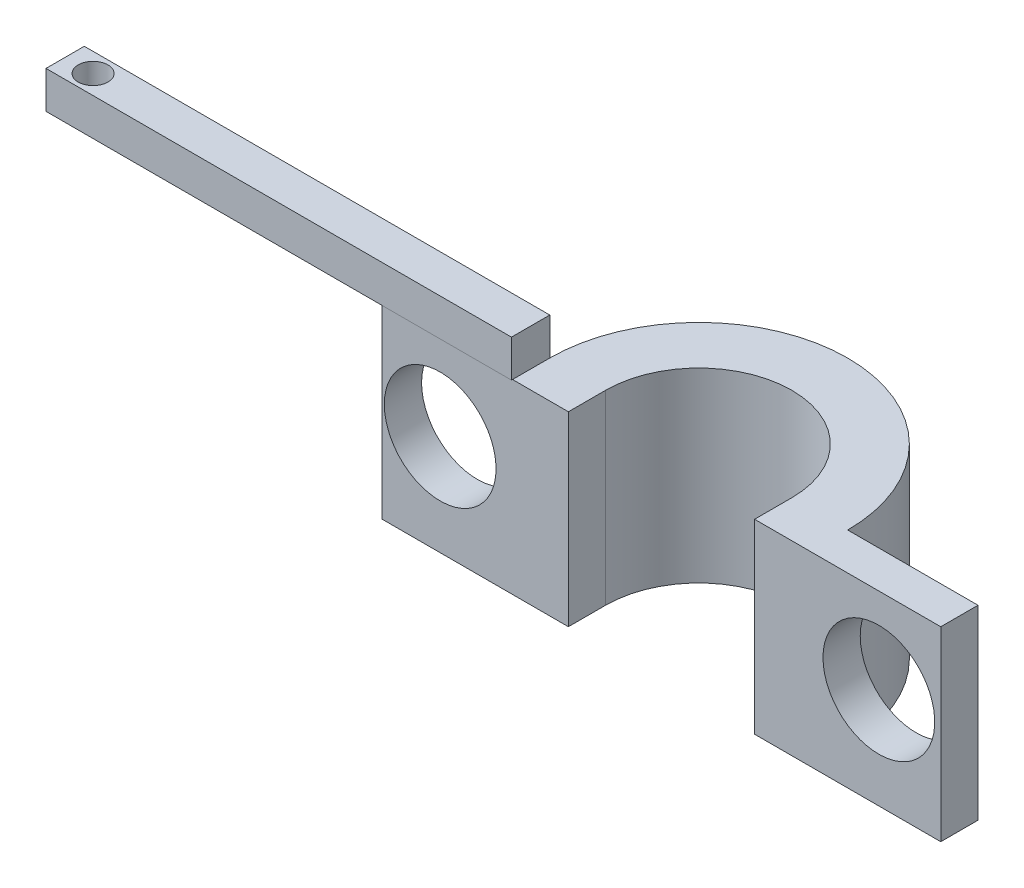
ISO-10303-21;
HEADER;
FILE_DESCRIPTION(('STEP AP214'),'2;1');
FILE_NAME('part.step','',(''),(''),'','','');
FILE_SCHEMA(('AUTOMOTIVE_DESIGN { 1 0 10303 214 1 1 1 1 }'));
ENDSEC;
DATA;
#1=APPLICATION_CONTEXT('core data for automotive mechanical design processes');
#2=APPLICATION_PROTOCOL_DEFINITION('international standard','automotive_design',2000,#1);
#3=PRODUCT_CONTEXT('',#1,'mechanical');
#4=PRODUCT('Part','Part','',(#3));
#5=PRODUCT_RELATED_PRODUCT_CATEGORY('part','',(#4));
#6=PRODUCT_DEFINITION_FORMATION('','',#4);
#7=PRODUCT_DEFINITION_CONTEXT('part definition',#1,'design');
#8=PRODUCT_DEFINITION('design','',#6,#7);
#9=PRODUCT_DEFINITION_SHAPE('','',#8);
#10=(LENGTH_UNIT() NAMED_UNIT(*) SI_UNIT(.MILLI.,.METRE.));
#11=(NAMED_UNIT(*) PLANE_ANGLE_UNIT() SI_UNIT($,.RADIAN.));
#12=(NAMED_UNIT(*) SI_UNIT($,.STERADIAN.) SOLID_ANGLE_UNIT());
#13=UNCERTAINTY_MEASURE_WITH_UNIT(LENGTH_MEASURE(1.E-05),#10,'distance_accuracy_value','');
#14=(GEOMETRIC_REPRESENTATION_CONTEXT(3) GLOBAL_UNCERTAINTY_ASSIGNED_CONTEXT((#13)) GLOBAL_UNIT_ASSIGNED_CONTEXT((#10,
#11,#12)) REPRESENTATION_CONTEXT('',''));
#15=CARTESIAN_POINT('',(0.,0.,0.));
#16=DIRECTION('',(0.,0.,1.));
#17=DIRECTION('',(1.,0.,0.));
#18=AXIS2_PLACEMENT_3D('',#15,#16,#17);
#19=CARTESIAN_POINT('',(0.,10.,0.));
#20=DIRECTION('',(0.,1.,0.));
#21=DIRECTION('',(0.,0.,1.));
#22=AXIS2_PLACEMENT_3D('',#19,#20,#21);
#23=PLANE('',#22);
#24=DIRECTION('',(0.,0.,-1.));
#25=VECTOR('',#24,1.);
#26=CARTESIAN_POINT('',(-8.,10.,0.));
#27=LINE('',#26,#25);
#28=CARTESIAN_POINT('',(-8.,10.,2.));
#29=VERTEX_POINT('',#28);
#30=CARTESIAN_POINT('',(-8.,10.,0.));
#31=VERTEX_POINT('',#30);
#32=EDGE_CURVE('E12',#29,#31,#27,.T.);
#33=ORIENTED_EDGE('',*,*,#32,.F.);
#34=DIRECTION('',(-1.,0.,0.));
#35=VECTOR('',#34,1.);
#36=CARTESIAN_POINT('',(-5.,10.,2.));
#37=LINE('',#36,#35);
#38=CARTESIAN_POINT('',(-5.,10.,2.));
#39=VERTEX_POINT('',#38);
#40=EDGE_CURVE('E290',#39,#29,#37,.T.);
#41=ORIENTED_EDGE('',*,*,#40,.F.);
#42=DIRECTION('',(0.,0.,-1.));
#43=VECTOR('',#42,1.);
#44=CARTESIAN_POINT('',(-5.,10.,2.));
#45=LINE('',#44,#43);
#46=CARTESIAN_POINT('',(-5.,10.,0.));
#47=VERTEX_POINT('',#46);
#48=EDGE_CURVE('E303',#39,#47,#45,.T.);
#49=ORIENTED_EDGE('',*,*,#48,.T.);
#50=CARTESIAN_POINT('',(0.,10.,0.));
#51=DIRECTION('',(0.,1.,0.));
#52=DIRECTION('',(0.,0.,1.));
#53=AXIS2_PLACEMENT_3D('',#50,#51,#52);
#54=CIRCLE('',#53,5.);
#55=CARTESIAN_POINT('',(5.,10.,0.));
#56=VERTEX_POINT('',#55);
#57=EDGE_CURVE('E338',#56,#47,#54,.T.);
#58=ORIENTED_EDGE('',*,*,#57,.F.);
#59=DIRECTION('',(0.,0.,-1.));
#60=VECTOR('',#59,1.);
#61=CARTESIAN_POINT('',(5.,10.,2.));
#62=LINE('',#61,#60);
#63=CARTESIAN_POINT('',(5.,10.,2.));
#64=VERTEX_POINT('',#63);
#65=EDGE_CURVE('E316',#64,#56,#62,.T.);
#66=ORIENTED_EDGE('',*,*,#65,.F.);
#67=DIRECTION('',(-1.,0.,0.));
#68=VECTOR('',#67,1.);
#69=CARTESIAN_POINT('',(5.,10.,2.));
#70=LINE('',#69,#68);
#71=CARTESIAN_POINT('',(15.,10.,2.));
#72=VERTEX_POINT('',#71);
#73=EDGE_CURVE('E314',#72,#64,#70,.T.);
#74=ORIENTED_EDGE('',*,*,#73,.F.);
#75=DIRECTION('',(0.,0.,-1.));
#76=VECTOR('',#75,1.);
#77=CARTESIAN_POINT('',(15.,10.,2.));
#78=LINE('',#77,#76);
#79=CARTESIAN_POINT('',(15.,10.,0.));
#80=VERTEX_POINT('',#79);
#81=EDGE_CURVE('E324',#72,#80,#78,.T.);
#82=ORIENTED_EDGE('',*,*,#81,.T.);
#83=DIRECTION('',(-1.,0.,0.));
#84=VECTOR('',#83,1.);
#85=CARTESIAN_POINT('',(5.,10.,0.));
#86=LINE('',#85,#84);
#87=CARTESIAN_POINT('',(8.,10.,0.));
#88=VERTEX_POINT('',#87);
#89=EDGE_CURVE('E310',#80,#88,#86,.T.);
#90=ORIENTED_EDGE('',*,*,#89,.T.);
#91=CARTESIAN_POINT('',(0.,10.,0.));
#92=DIRECTION('',(0.,1.,0.));
#93=DIRECTION('',(1.,0.,0.));
#94=AXIS2_PLACEMENT_3D('',#91,#92,#93);
#95=CIRCLE('',#94,8.);
#96=EDGE_CURVE('E343',#88,#31,#95,.T.);
#97=ORIENTED_EDGE('',*,*,#96,.T.);
#98=EDGE_LOOP('',(#33,#41,#49,#58,#66,#74,#82,#90,#97));
#99=FACE_BOUND('',#98,.T.);
#100=ADVANCED_FACE('F39',(#99),#23,.T.);
#101=CARTESIAN_POINT('',(0.,0.,0.));
#102=DIRECTION('',(0.,1.,0.));
#103=DIRECTION('',(0.,0.,1.));
#104=AXIS2_PLACEMENT_3D('',#101,#102,#103);
#105=PLANE('',#104);
#106=CARTESIAN_POINT('',(0.,0.,0.));
#107=DIRECTION('',(0.,1.,0.));
#108=DIRECTION('',(1.,0.,0.));
#109=AXIS2_PLACEMENT_3D('',#106,#107,#108);
#110=CIRCLE('',#109,8.);
#111=CARTESIAN_POINT('',(8.,0.,0.));
#112=VERTEX_POINT('',#111);
#113=CARTESIAN_POINT('',(-8.,0.,0.));
#114=VERTEX_POINT('',#113);
#115=EDGE_CURVE('E341',#112,#114,#110,.T.);
#116=ORIENTED_EDGE('',*,*,#115,.F.);
#117=DIRECTION('',(1.,0.,0.));
#118=VECTOR('',#117,1.);
#119=CARTESIAN_POINT('',(5.,0.,0.));
#120=LINE('',#119,#118);
#121=CARTESIAN_POINT('',(15.,0.,0.));
#122=VERTEX_POINT('',#121);
#123=EDGE_CURVE('E305',#112,#122,#120,.T.);
#124=ORIENTED_EDGE('',*,*,#123,.T.);
#125=DIRECTION('',(0.,0.,-1.));
#126=VECTOR('',#125,1.);
#127=CARTESIAN_POINT('',(15.,0.,2.));
#128=LINE('',#127,#126);
#129=CARTESIAN_POINT('',(15.,0.,2.));
#130=VERTEX_POINT('',#129);
#131=EDGE_CURVE('E327',#130,#122,#128,.T.);
#132=ORIENTED_EDGE('',*,*,#131,.F.);
#133=DIRECTION('',(1.,0.,0.));
#134=VECTOR('',#133,1.);
#135=CARTESIAN_POINT('',(5.,0.,2.));
#136=LINE('',#135,#134);
#137=CARTESIAN_POINT('',(5.,0.,2.));
#138=VERTEX_POINT('',#137);
#139=EDGE_CURVE('E309',#138,#130,#136,.T.);
#140=ORIENTED_EDGE('',*,*,#139,.F.);
#141=DIRECTION('',(0.,0.,-1.));
#142=VECTOR('',#141,1.);
#143=CARTESIAN_POINT('',(5.,0.,2.));
#144=LINE('',#143,#142);
#145=CARTESIAN_POINT('',(5.,0.,0.));
#146=VERTEX_POINT('',#145);
#147=EDGE_CURVE('E330',#138,#146,#144,.T.);
#148=ORIENTED_EDGE('',*,*,#147,.T.);
#149=CARTESIAN_POINT('',(0.,0.,0.));
#150=DIRECTION('',(0.,1.,0.));
#151=DIRECTION('',(0.,0.,1.));
#152=AXIS2_PLACEMENT_3D('',#149,#150,#151);
#153=CIRCLE('',#152,5.);
#154=CARTESIAN_POINT('',(-5.,0.,0.));
#155=VERTEX_POINT('',#154);
#156=EDGE_CURVE('E63',#146,#155,#153,.T.);
#157=ORIENTED_EDGE('',*,*,#156,.T.);
#158=DIRECTION('',(0.,0.,-1.));
#159=VECTOR('',#158,1.);
#160=CARTESIAN_POINT('',(-5.,0.,2.));
#161=LINE('',#160,#159);
#162=CARTESIAN_POINT('',(-5.,0.,2.));
#163=VERTEX_POINT('',#162);
#164=EDGE_CURVE('E296',#163,#155,#161,.T.);
#165=ORIENTED_EDGE('',*,*,#164,.F.);
#166=DIRECTION('',(1.,0.,0.));
#167=VECTOR('',#166,1.);
#168=CARTESIAN_POINT('',(-5.,0.,2.));
#169=LINE('',#168,#167);
#170=CARTESIAN_POINT('',(-15.,0.,2.));
#171=VERTEX_POINT('',#170);
#172=EDGE_CURVE('E294',#171,#163,#169,.T.);
#173=ORIENTED_EDGE('',*,*,#172,.F.);
#174=DIRECTION('',(0.,0.,-1.));
#175=VECTOR('',#174,1.);
#176=CARTESIAN_POINT('',(-15.,0.,2.));
#177=LINE('',#176,#175);
#178=CARTESIAN_POINT('',(-15.,0.,0.));
#179=VERTEX_POINT('',#178);
#180=EDGE_CURVE('E299',#171,#179,#177,.T.);
#181=ORIENTED_EDGE('',*,*,#180,.T.);
#182=DIRECTION('',(1.,0.,0.));
#183=VECTOR('',#182,1.);
#184=CARTESIAN_POINT('',(-5.,0.,0.));
#185=LINE('',#184,#183);
#186=EDGE_CURVE('E289',#179,#114,#185,.T.);
#187=ORIENTED_EDGE('',*,*,#186,.T.);
#188=EDGE_LOOP('',(#116,#124,#132,#140,#148,#157,#165,#173,#181,#187));
#189=FACE_BOUND('',#188,.T.);
#190=ADVANCED_FACE('F219',(#189),#105,.F.);
#191=CARTESIAN_POINT('',(0.,10.,0.));
#192=DIRECTION('',(0.,-1.,0.));
#193=DIRECTION('',(0.,0.,-1.));
#194=AXIS2_PLACEMENT_3D('',#191,#192,#193);
#195=CYLINDRICAL_SURFACE('',#194,8.);
#196=ORIENTED_EDGE('',*,*,#96,.F.);
#197=DIRECTION('',(0.,1.,0.));
#198=VECTOR('',#197,1.);
#199=CARTESIAN_POINT('',(8.,0.,0.));
#200=LINE('',#199,#198);
#201=EDGE_CURVE('E332',#112,#88,#200,.T.);
#202=ORIENTED_EDGE('',*,*,#201,.F.);
#203=ORIENTED_EDGE('',*,*,#115,.T.);
#204=DIRECTION('',(0.,1.,0.));
#205=VECTOR('',#204,1.);
#206=CARTESIAN_POINT('',(-8.,0.,0.));
#207=LINE('',#206,#205);
#208=EDGE_CURVE('E333',#114,#31,#207,.T.);
#209=ORIENTED_EDGE('',*,*,#208,.T.);
#210=EDGE_LOOP('',(#196,#202,#203,#209));
#211=FACE_BOUND('',#210,.T.);
#212=ADVANCED_FACE('F41',(#211),#195,.T.);
#213=CARTESIAN_POINT('',(0.,10.,0.));
#214=DIRECTION('',(0.,-1.,0.));
#215=DIRECTION('',(0.,0.,-1.));
#216=AXIS2_PLACEMENT_3D('',#213,#214,#215);
#217=CYLINDRICAL_SURFACE('',#216,5.);
#218=DIRECTION('',(0.,-1.,0.));
#219=VECTOR('',#218,1.);
#220=CARTESIAN_POINT('',(5.,10.,0.));
#221=LINE('',#220,#219);
#222=EDGE_CURVE('E48',#56,#146,#221,.T.);
#223=ORIENTED_EDGE('',*,*,#222,.F.);
#224=ORIENTED_EDGE('',*,*,#57,.T.);
#225=DIRECTION('',(0.,-1.,0.));
#226=VECTOR('',#225,1.);
#227=CARTESIAN_POINT('',(-5.,10.,0.));
#228=LINE('',#227,#226);
#229=EDGE_CURVE('E345',#155,#47,#228,.F.);
#230=ORIENTED_EDGE('',*,*,#229,.F.);
#231=ORIENTED_EDGE('',*,*,#156,.F.);
#232=EDGE_LOOP('',(#223,#224,#230,#231));
#233=FACE_BOUND('',#232,.T.);
#234=ADVANCED_FACE('F228',(#233),#217,.F.);
#235=CARTESIAN_POINT('',(0.,0.,0.));
#236=DIRECTION('',(0.,0.,1.));
#237=DIRECTION('',(1.,0.,0.));
#238=AXIS2_PLACEMENT_3D('',#235,#236,#237);
#239=PLANE('',#238);
#240=CARTESIAN_POINT('',(11.6742620763688,5.40681404768861,0.));
#241=DIRECTION('',(0.,0.,-1.));
#242=DIRECTION('',(-1.,0.,0.));
#243=AXIS2_PLACEMENT_3D('',#240,#241,#242);
#244=CIRCLE('',#243,3.);
#245=CARTESIAN_POINT('',(8.67426207636879,5.40681404768861,0.));
#246=VERTEX_POINT('',#245);
#247=EDGE_CURVE('E276',#246,#246,#244,.T.);
#248=ORIENTED_EDGE('',*,*,#247,.F.);
#249=EDGE_LOOP('',(#248));
#250=FACE_BOUND('',#249,.T.);
#251=ORIENTED_EDGE('',*,*,#123,.F.);
#252=ORIENTED_EDGE('',*,*,#201,.T.);
#253=ORIENTED_EDGE('',*,*,#89,.F.);
#254=DIRECTION('',(0.,1.,0.));
#255=VECTOR('',#254,1.);
#256=CARTESIAN_POINT('',(15.,10.,0.));
#257=LINE('',#256,#255);
#258=EDGE_CURVE('E318',#122,#80,#257,.T.);
#259=ORIENTED_EDGE('',*,*,#258,.F.);
#260=EDGE_LOOP('',(#251,#252,#253,#259));
#261=FACE_BOUND('',#260,.T.);
#262=ADVANCED_FACE('F231',(#250,#261),#239,.F.);
#263=CARTESIAN_POINT('',(5.,10.,2.));
#264=DIRECTION('',(1.,0.,0.));
#265=DIRECTION('',(0.,0.,-1.));
#266=AXIS2_PLACEMENT_3D('',#263,#264,#265);
#267=PLANE('',#266);
#268=ORIENTED_EDGE('',*,*,#222,.T.);
#269=ORIENTED_EDGE('',*,*,#147,.F.);
#270=DIRECTION('',(0.,-1.,0.));
#271=VECTOR('',#270,1.);
#272=CARTESIAN_POINT('',(5.,10.,2.));
#273=LINE('',#272,#271);
#274=EDGE_CURVE('E306',#64,#138,#273,.T.);
#275=ORIENTED_EDGE('',*,*,#274,.F.);
#276=ORIENTED_EDGE('',*,*,#65,.T.);
#277=EDGE_LOOP('',(#268,#269,#275,#276));
#278=FACE_BOUND('',#277,.T.);
#279=ADVANCED_FACE('F232',(#278),#267,.F.);
#280=CARTESIAN_POINT('',(15.,10.,2.));
#281=DIRECTION('',(-1.,0.,0.));
#282=DIRECTION('',(0.,-1.,0.));
#283=AXIS2_PLACEMENT_3D('',#280,#281,#282);
#284=PLANE('',#283);
#285=ORIENTED_EDGE('',*,*,#258,.T.);
#286=ORIENTED_EDGE('',*,*,#81,.F.);
#287=DIRECTION('',(0.,1.,0.));
#288=VECTOR('',#287,1.);
#289=CARTESIAN_POINT('',(15.,10.,2.));
#290=LINE('',#289,#288);
#291=EDGE_CURVE('E312',#130,#72,#290,.T.);
#292=ORIENTED_EDGE('',*,*,#291,.F.);
#293=ORIENTED_EDGE('',*,*,#131,.T.);
#294=EDGE_LOOP('',(#285,#286,#292,#293));
#295=FACE_BOUND('',#294,.T.);
#296=ADVANCED_FACE('F235',(#295),#284,.F.);
#297=CARTESIAN_POINT('',(0.,0.,2.));
#298=DIRECTION('',(0.,0.,1.));
#299=DIRECTION('',(1.,0.,0.));
#300=AXIS2_PLACEMENT_3D('',#297,#298,#299);
#301=PLANE('',#300);
#302=CARTESIAN_POINT('',(11.6742620763688,5.40681404768861,2.));
#303=DIRECTION('',(0.,0.,-1.));
#304=DIRECTION('',(-1.,0.,0.));
#305=AXIS2_PLACEMENT_3D('',#302,#303,#304);
#306=CIRCLE('',#305,3.);
#307=CARTESIAN_POINT('',(8.67426207636879,5.40681404768861,2.));
#308=VERTEX_POINT('',#307);
#309=EDGE_CURVE('E278',#308,#308,#306,.T.);
#310=ORIENTED_EDGE('',*,*,#309,.T.);
#311=EDGE_LOOP('',(#310));
#312=FACE_BOUND('',#311,.T.);
#313=ORIENTED_EDGE('',*,*,#274,.T.);
#314=ORIENTED_EDGE('',*,*,#139,.T.);
#315=ORIENTED_EDGE('',*,*,#291,.T.);
#316=ORIENTED_EDGE('',*,*,#73,.T.);
#317=EDGE_LOOP('',(#313,#314,#315,#316));
#318=FACE_BOUND('',#317,.T.);
#319=ADVANCED_FACE('F239',(#312,#318),#301,.T.);
#320=CARTESIAN_POINT('',(0.,0.,0.));
#321=DIRECTION('',(0.,0.,-1.));
#322=DIRECTION('',(-1.,0.,0.));
#323=AXIS2_PLACEMENT_3D('',#320,#321,#322);
#324=PLANE('',#323);
#325=CARTESIAN_POINT('',(-11.8859313947723,5.40681404768861,0.));
#326=DIRECTION('',(0.,0.,-1.));
#327=DIRECTION('',(-1.,0.,0.));
#328=AXIS2_PLACEMENT_3D('',#325,#326,#327);
#329=CIRCLE('',#328,3.);
#330=CARTESIAN_POINT('',(-14.8859313947723,5.40681404768861,0.));
#331=VERTEX_POINT('',#330);
#332=EDGE_CURVE('E167',#331,#331,#329,.T.);
#333=ORIENTED_EDGE('',*,*,#332,.F.);
#334=EDGE_LOOP('',(#333));
#335=FACE_BOUND('',#334,.T.);
#336=ORIENTED_EDGE('',*,*,#208,.F.);
#337=ORIENTED_EDGE('',*,*,#186,.F.);
#338=DIRECTION('',(0.,-1.,0.));
#339=VECTOR('',#338,1.);
#340=CARTESIAN_POINT('',(-15.,10.,0.));
#341=LINE('',#340,#339);
#342=CARTESIAN_POINT('',(-15.,10.,0.));
#343=VERTEX_POINT('',#342);
#344=EDGE_CURVE('E283',#343,#179,#341,.T.);
#345=ORIENTED_EDGE('',*,*,#344,.F.);
#346=DIRECTION('',(-1.,0.,0.));
#347=VECTOR('',#346,1.);
#348=CARTESIAN_POINT('',(-8.,10.,0.));
#349=LINE('',#348,#347);
#350=CARTESIAN_POINT('',(-33.,10.,0.));
#351=VERTEX_POINT('',#350);
#352=EDGE_CURVE('E176',#343,#351,#349,.T.);
#353=ORIENTED_EDGE('',*,*,#352,.T.);
#354=DIRECTION('',(0.,-1.,0.));
#355=VECTOR('',#354,1.);
#356=CARTESIAN_POINT('',(-33.,12.,0.));
#357=LINE('',#356,#355);
#358=CARTESIAN_POINT('',(-33.,12.,0.));
#359=VERTEX_POINT('',#358);
#360=EDGE_CURVE('E150',#359,#351,#357,.T.);
#361=ORIENTED_EDGE('',*,*,#360,.F.);
#362=DIRECTION('',(-1.,0.,0.));
#363=VECTOR('',#362,1.);
#364=CARTESIAN_POINT('',(-8.,12.,0.));
#365=LINE('',#364,#363);
#366=CARTESIAN_POINT('',(-8.,12.,0.));
#367=VERTEX_POINT('',#366);
#368=EDGE_CURVE('E143',#367,#359,#365,.T.);
#369=ORIENTED_EDGE('',*,*,#368,.F.);
#370=DIRECTION('',(0.,-1.,0.));
#371=VECTOR('',#370,1.);
#372=CARTESIAN_POINT('',(-8.,12.,0.));
#373=LINE('',#372,#371);
#374=EDGE_CURVE('E148',#367,#31,#373,.T.);
#375=ORIENTED_EDGE('',*,*,#374,.T.);
#376=EDGE_LOOP('',(#336,#337,#345,#353,#361,#369,#375));
#377=FACE_BOUND('',#376,.T.);
#378=ADVANCED_FACE('F146',(#335,#377),#324,.T.);
#379=CARTESIAN_POINT('',(-5.,10.,2.));
#380=DIRECTION('',(-1.,0.,0.));
#381=DIRECTION('',(0.,0.,1.));
#382=AXIS2_PLACEMENT_3D('',#379,#380,#381);
#383=PLANE('',#382);
#384=ORIENTED_EDGE('',*,*,#229,.T.);
#385=ORIENTED_EDGE('',*,*,#48,.F.);
#386=DIRECTION('',(0.,1.,0.));
#387=VECTOR('',#386,1.);
#388=CARTESIAN_POINT('',(-5.,10.,2.));
#389=LINE('',#388,#387);
#390=EDGE_CURVE('E286',#163,#39,#389,.T.);
#391=ORIENTED_EDGE('',*,*,#390,.F.);
#392=ORIENTED_EDGE('',*,*,#164,.T.);
#393=EDGE_LOOP('',(#384,#385,#391,#392));
#394=FACE_BOUND('',#393,.T.);
#395=ADVANCED_FACE('F247',(#394),#383,.F.);
#396=CARTESIAN_POINT('',(-15.,10.,2.));
#397=DIRECTION('',(1.,0.,0.));
#398=DIRECTION('',(0.,1.,0.));
#399=AXIS2_PLACEMENT_3D('',#396,#397,#398);
#400=PLANE('',#399);
#401=ORIENTED_EDGE('',*,*,#344,.T.);
#402=ORIENTED_EDGE('',*,*,#180,.F.);
#403=DIRECTION('',(0.,-1.,0.));
#404=VECTOR('',#403,1.);
#405=CARTESIAN_POINT('',(-15.,10.,2.));
#406=LINE('',#405,#404);
#407=CARTESIAN_POINT('',(-15.,10.,2.));
#408=VERTEX_POINT('',#407);
#409=EDGE_CURVE('E292',#408,#171,#406,.T.);
#410=ORIENTED_EDGE('',*,*,#409,.F.);
#411=DIRECTION('',(0.,0.,-1.));
#412=VECTOR('',#411,1.);
#413=CARTESIAN_POINT('',(-15.,10.,2.));
#414=LINE('',#413,#412);
#415=EDGE_CURVE('E302',#408,#343,#414,.T.);
#416=ORIENTED_EDGE('',*,*,#415,.T.);
#417=EDGE_LOOP('',(#401,#402,#410,#416));
#418=FACE_BOUND('',#417,.T.);
#419=ADVANCED_FACE('F250',(#418),#400,.F.);
#420=CARTESIAN_POINT('',(0.,0.,2.));
#421=DIRECTION('',(0.,0.,-1.));
#422=DIRECTION('',(-1.,0.,0.));
#423=AXIS2_PLACEMENT_3D('',#420,#421,#422);
#424=PLANE('',#423);
#425=CARTESIAN_POINT('',(-11.8859313947723,5.40681404768861,2.));
#426=DIRECTION('',(0.,0.,-1.));
#427=DIRECTION('',(-1.,0.,0.));
#428=AXIS2_PLACEMENT_3D('',#425,#426,#427);
#429=CIRCLE('',#428,3.);
#430=CARTESIAN_POINT('',(-14.8859313947723,5.40681404768861,2.));
#431=VERTEX_POINT('',#430);
#432=EDGE_CURVE('E170',#431,#431,#429,.T.);
#433=ORIENTED_EDGE('',*,*,#432,.T.);
#434=EDGE_LOOP('',(#433));
#435=FACE_BOUND('',#434,.T.);
#436=ORIENTED_EDGE('',*,*,#390,.T.);
#437=ORIENTED_EDGE('',*,*,#40,.T.);
#438=EDGE_CURVE('E199',#29,#408,#37,.T.);
#439=ORIENTED_EDGE('',*,*,#438,.T.);
#440=ORIENTED_EDGE('',*,*,#409,.T.);
#441=ORIENTED_EDGE('',*,*,#172,.T.);
#442=EDGE_LOOP('',(#436,#437,#439,#440,#441));
#443=FACE_BOUND('',#442,.T.);
#444=ADVANCED_FACE('F254',(#435,#443),#424,.F.);
#445=CARTESIAN_POINT('',(11.6742620763688,5.40681404768861,2.));
#446=DIRECTION('',(0.,0.,-1.));
#447=DIRECTION('',(-1.,0.,0.));
#448=AXIS2_PLACEMENT_3D('',#445,#446,#447);
#449=CYLINDRICAL_SURFACE('',#448,3.);
#450=ORIENTED_EDGE('',*,*,#309,.F.);
#451=EDGE_LOOP('',(#450));
#452=FACE_BOUND('',#451,.T.);
#453=ORIENTED_EDGE('',*,*,#247,.T.);
#454=EDGE_LOOP('',(#453));
#455=FACE_BOUND('',#454,.T.);
#456=ADVANCED_FACE('F261',(#452,#455),#449,.F.);
#457=CARTESIAN_POINT('',(-11.8859313947723,5.40681404768861,2.));
#458=DIRECTION('',(0.,0.,-1.));
#459=DIRECTION('',(-1.,0.,0.));
#460=AXIS2_PLACEMENT_3D('',#457,#458,#459);
#461=CYLINDRICAL_SURFACE('',#460,3.);
#462=ORIENTED_EDGE('',*,*,#432,.F.);
#463=EDGE_LOOP('',(#462));
#464=FACE_BOUND('',#463,.T.);
#465=ORIENTED_EDGE('',*,*,#332,.T.);
#466=EDGE_LOOP('',(#465));
#467=FACE_BOUND('',#466,.T.);
#468=ADVANCED_FACE('F265',(#464,#467),#461,.F.);
#469=CARTESIAN_POINT('',(0.,10.,0.));
#470=DIRECTION('',(0.,-1.,0.));
#471=DIRECTION('',(0.,0.,-1.));
#472=AXIS2_PLACEMENT_3D('',#469,#470,#471);
#473=PLANE('',#472);
#474=CARTESIAN_POINT('',(-31.5,10.,1.02926148747429));
#475=DIRECTION('',(0.,1.,0.));
#476=DIRECTION('',(0.,0.,1.));
#477=AXIS2_PLACEMENT_3D('',#474,#475,#476);
#478=CIRCLE('',#477,0.799999999999999);
#479=CARTESIAN_POINT('',(-31.5,10.,1.82926148747429));
#480=VERTEX_POINT('',#479);
#481=EDGE_CURVE('E200',#480,#480,#478,.T.);
#482=ORIENTED_EDGE('',*,*,#481,.T.);
#483=EDGE_LOOP('',(#482));
#484=FACE_BOUND('',#483,.T.);
#485=ORIENTED_EDGE('',*,*,#415,.F.);
#486=ORIENTED_EDGE('',*,*,#438,.F.);
#487=CARTESIAN_POINT('',(-8.,10.,2.05762305110113));
#488=VERTEX_POINT('',#487);
#489=EDGE_CURVE('E50',#488,#29,#27,.T.);
#490=ORIENTED_EDGE('',*,*,#489,.F.);
#491=DIRECTION('',(1.,0.,0.));
#492=VECTOR('',#491,1.);
#493=CARTESIAN_POINT('',(-8.,10.,2.05762305110113));
#494=LINE('',#493,#492);
#495=CARTESIAN_POINT('',(-33.,10.,2.05762305110114));
#496=VERTEX_POINT('',#495);
#497=EDGE_CURVE('E163',#496,#488,#494,.T.);
#498=ORIENTED_EDGE('',*,*,#497,.F.);
#499=DIRECTION('',(0.,0.,1.));
#500=VECTOR('',#499,1.);
#501=CARTESIAN_POINT('',(-33.,10.,0.));
#502=LINE('',#501,#500);
#503=EDGE_CURVE('E179',#351,#496,#502,.T.);
#504=ORIENTED_EDGE('',*,*,#503,.F.);
#505=ORIENTED_EDGE('',*,*,#352,.F.);
#506=EDGE_LOOP('',(#485,#486,#490,#498,#504,#505));
#507=FACE_BOUND('',#506,.T.);
#508=ADVANCED_FACE('F196',(#484,#507),#473,.T.);
#509=CARTESIAN_POINT('',(-8.,12.,0.));
#510=DIRECTION('',(-1.,0.,0.));
#511=DIRECTION('',(0.,0.,1.));
#512=AXIS2_PLACEMENT_3D('',#509,#510,#511);
#513=PLANE('',#512);
#514=ORIENTED_EDGE('',*,*,#489,.T.);
#515=ORIENTED_EDGE('',*,*,#32,.T.);
#516=ORIENTED_EDGE('',*,*,#374,.F.);
#517=DIRECTION('',(0.,0.,-1.));
#518=VECTOR('',#517,1.);
#519=CARTESIAN_POINT('',(-8.,12.,0.));
#520=LINE('',#519,#518);
#521=CARTESIAN_POINT('',(-8.,12.,2.05762305110113));
#522=VERTEX_POINT('',#521);
#523=EDGE_CURVE('E154',#522,#367,#520,.T.);
#524=ORIENTED_EDGE('',*,*,#523,.F.);
#525=DIRECTION('',(0.,-1.,0.));
#526=VECTOR('',#525,1.);
#527=CARTESIAN_POINT('',(-8.,12.,2.05762305110113));
#528=LINE('',#527,#526);
#529=EDGE_CURVE('E185',#522,#488,#528,.T.);
#530=ORIENTED_EDGE('',*,*,#529,.T.);
#531=EDGE_LOOP('',(#514,#515,#516,#524,#530));
#532=FACE_BOUND('',#531,.T.);
#533=ADVANCED_FACE('F166',(#532),#513,.F.);
#534=CARTESIAN_POINT('',(-33.,12.,0.));
#535=DIRECTION('',(1.,0.,0.));
#536=DIRECTION('',(0.,0.,-1.));
#537=AXIS2_PLACEMENT_3D('',#534,#535,#536);
#538=PLANE('',#537);
#539=ORIENTED_EDGE('',*,*,#503,.T.);
#540=DIRECTION('',(0.,-1.,0.));
#541=VECTOR('',#540,1.);
#542=CARTESIAN_POINT('',(-33.,12.,2.05762305110114));
#543=LINE('',#542,#541);
#544=CARTESIAN_POINT('',(-33.,12.,2.05762305110114));
#545=VERTEX_POINT('',#544);
#546=EDGE_CURVE('E172',#545,#496,#543,.T.);
#547=ORIENTED_EDGE('',*,*,#546,.F.);
#548=DIRECTION('',(0.,0.,1.));
#549=VECTOR('',#548,1.);
#550=CARTESIAN_POINT('',(-33.,12.,0.));
#551=LINE('',#550,#549);
#552=EDGE_CURVE('E153',#359,#545,#551,.T.);
#553=ORIENTED_EDGE('',*,*,#552,.F.);
#554=ORIENTED_EDGE('',*,*,#360,.T.);
#555=EDGE_LOOP('',(#539,#547,#553,#554));
#556=FACE_BOUND('',#555,.T.);
#557=ADVANCED_FACE('F209',(#556),#538,.F.);
#558=CARTESIAN_POINT('',(-8.,12.,2.05762305110113));
#559=DIRECTION('',(0.,0.,-1.));
#560=DIRECTION('',(-1.,0.,0.));
#561=AXIS2_PLACEMENT_3D('',#558,#559,#560);
#562=PLANE('',#561);
#563=ORIENTED_EDGE('',*,*,#497,.T.);
#564=ORIENTED_EDGE('',*,*,#529,.F.);
#565=DIRECTION('',(1.,0.,0.));
#566=VECTOR('',#565,1.);
#567=CARTESIAN_POINT('',(-8.,12.,2.05762305110113));
#568=LINE('',#567,#566);
#569=EDGE_CURVE('E159',#545,#522,#568,.T.);
#570=ORIENTED_EDGE('',*,*,#569,.F.);
#571=ORIENTED_EDGE('',*,*,#546,.T.);
#572=EDGE_LOOP('',(#563,#564,#570,#571));
#573=FACE_BOUND('',#572,.T.);
#574=ADVANCED_FACE('F190',(#573),#562,.F.);
#575=CARTESIAN_POINT('',(0.,12.,0.));
#576=DIRECTION('',(0.,-1.,0.));
#577=DIRECTION('',(0.,0.,-1.));
#578=AXIS2_PLACEMENT_3D('',#575,#576,#577);
#579=PLANE('',#578);
#580=CARTESIAN_POINT('',(-31.5,12.,1.02926148747429));
#581=DIRECTION('',(0.,1.,0.));
#582=DIRECTION('',(0.,0.,1.));
#583=AXIS2_PLACEMENT_3D('',#580,#581,#582);
#584=CIRCLE('',#583,0.799999999999999);
#585=CARTESIAN_POINT('',(-31.5,12.,1.82926148747429));
#586=VERTEX_POINT('',#585);
#587=EDGE_CURVE('E202',#586,#586,#584,.T.);
#588=ORIENTED_EDGE('',*,*,#587,.F.);
#589=EDGE_LOOP('',(#588));
#590=FACE_BOUND('',#589,.T.);
#591=ORIENTED_EDGE('',*,*,#523,.T.);
#592=ORIENTED_EDGE('',*,*,#368,.T.);
#593=ORIENTED_EDGE('',*,*,#552,.T.);
#594=ORIENTED_EDGE('',*,*,#569,.T.);
#595=EDGE_LOOP('',(#591,#592,#593,#594));
#596=FACE_BOUND('',#595,.T.);
#597=ADVANCED_FACE('F157',(#590,#596),#579,.F.);
#598=CARTESIAN_POINT('',(-31.5,10.,1.02926148747429));
#599=DIRECTION('',(0.,1.,0.));
#600=DIRECTION('',(0.,0.,1.));
#601=AXIS2_PLACEMENT_3D('',#598,#599,#600);
#602=CYLINDRICAL_SURFACE('',#601,0.799999999999999);
#603=ORIENTED_EDGE('',*,*,#481,.F.);
#604=EDGE_LOOP('',(#603));
#605=FACE_BOUND('',#604,.T.);
#606=ORIENTED_EDGE('',*,*,#587,.T.);
#607=EDGE_LOOP('',(#606));
#608=FACE_BOUND('',#607,.T.);
#609=ADVANCED_FACE('F462',(#605,#608),#602,.F.);
#610=CLOSED_SHELL('',(#100,#190,#212,#234,#262,#279,#296,#319,#378,#395,#419,#444,#456,#468,
#508,#533,#557,#574,#597,#609));
#611=MANIFOLD_SOLID_BREP('B2',#610);
#612=ADVANCED_BREP_SHAPE_REPRESENTATION('',(#18,#611),#14);
#613=SHAPE_DEFINITION_REPRESENTATION(#9,#612);
ENDSEC;
END-ISO-10303-21;
